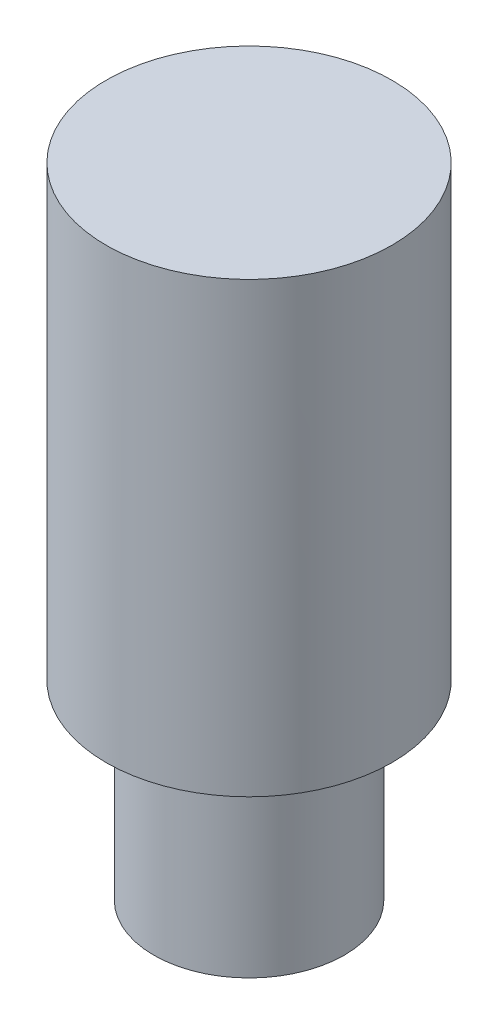
ISO-10303-21;
HEADER;
FILE_DESCRIPTION(('STEP AP214'),'2;1');
FILE_NAME('part.step','',(''),(''),'','','');
FILE_SCHEMA(('AUTOMOTIVE_DESIGN { 1 0 10303 214 1 1 1 1 }'));
ENDSEC;
DATA;
#1=APPLICATION_CONTEXT('core data for automotive mechanical design processes');
#2=APPLICATION_PROTOCOL_DEFINITION('international standard','automotive_design',2000,#1);
#3=PRODUCT_CONTEXT('',#1,'mechanical');
#4=PRODUCT('Part','Part','',(#3));
#5=PRODUCT_RELATED_PRODUCT_CATEGORY('part','',(#4));
#6=PRODUCT_DEFINITION_FORMATION('','',#4);
#7=PRODUCT_DEFINITION_CONTEXT('part definition',#1,'design');
#8=PRODUCT_DEFINITION('design','',#6,#7);
#9=PRODUCT_DEFINITION_SHAPE('','',#8);
#10=(LENGTH_UNIT() NAMED_UNIT(*) SI_UNIT(.MILLI.,.METRE.));
#11=(NAMED_UNIT(*) PLANE_ANGLE_UNIT() SI_UNIT($,.RADIAN.));
#12=(NAMED_UNIT(*) SI_UNIT($,.STERADIAN.) SOLID_ANGLE_UNIT());
#13=UNCERTAINTY_MEASURE_WITH_UNIT(LENGTH_MEASURE(1.E-05),#10,'distance_accuracy_value','');
#14=(GEOMETRIC_REPRESENTATION_CONTEXT(3) GLOBAL_UNCERTAINTY_ASSIGNED_CONTEXT((#13)) GLOBAL_UNIT_ASSIGNED_CONTEXT((#10,
#11,#12)) REPRESENTATION_CONTEXT('',''));
#15=CARTESIAN_POINT('',(0.,0.,0.));
#16=DIRECTION('',(0.,0.,1.));
#17=DIRECTION('',(1.,0.,0.));
#18=AXIS2_PLACEMENT_3D('',#15,#16,#17);
#19=CARTESIAN_POINT('',(0.,2.5,0.));
#20=DIRECTION('',(0.,1.,0.));
#21=DIRECTION('',(0.,0.,1.));
#22=AXIS2_PLACEMENT_3D('',#19,#20,#21);
#23=PLANE('',#22);
#24=CARTESIAN_POINT('',(0.,2.5,0.));
#25=DIRECTION('',(0.,1.,0.));
#26=DIRECTION('',(0.,0.,1.));
#27=AXIS2_PLACEMENT_3D('',#24,#25,#26);
#28=CIRCLE('',#27,3.75);
#29=CARTESIAN_POINT('',(0.,2.5,3.75));
#30=VERTEX_POINT('',#29);
#31=EDGE_CURVE('E48',#30,#30,#28,.T.);
#32=ORIENTED_EDGE('',*,*,#31,.F.);
#33=EDGE_LOOP('',(#32));
#34=FACE_BOUND('',#33,.T.);
#35=ADVANCED_FACE('F41',(#34),#23,.F.);
#36=CARTESIAN_POINT('',(0.,24.8614682080936,0.));
#37=DIRECTION('',(0.,-1.,0.));
#38=DIRECTION('',(0.,0.,-1.));
#39=AXIS2_PLACEMENT_3D('',#36,#37,#38);
#40=CYLINDRICAL_SURFACE('',#39,3.75);
#41=CARTESIAN_POINT('',(0.,14.2548664902954,0.));
#42=DIRECTION('',(0.,-1.,0.));
#43=DIRECTION('',(1.,0.,0.));
#44=AXIS2_PLACEMENT_3D('',#41,#42,#43);
#45=CIRCLE('',#44,3.75);
#46=CARTESIAN_POINT('',(3.75,14.2548664902954,0.));
#47=VERTEX_POINT('',#46);
#48=EDGE_CURVE('E11',#47,#47,#45,.T.);
#49=ORIENTED_EDGE('',*,*,#48,.T.);
#50=EDGE_LOOP('',(#49));
#51=FACE_BOUND('',#50,.T.);
#52=ORIENTED_EDGE('',*,*,#31,.T.);
#53=EDGE_LOOP('',(#52));
#54=FACE_BOUND('',#53,.T.);
#55=ADVANCED_FACE('F43',(#51,#54),#40,.T.);
#56=CARTESIAN_POINT('',(-1.54855022185249,14.2548664902954,3.12902341488536));
#57=DIRECTION('',(0.,-1.,0.));
#58=DIRECTION('',(-0.97166987360786,0.,0.236342244896854));
#59=AXIS2_PLACEMENT_3D('',#56,#57,#58);
#60=PLANE('',#59);
#61=ORIENTED_EDGE('',*,*,#48,.F.);
#62=EDGE_LOOP('',(#61));
#63=FACE_BOUND('',#62,.T.);
#64=ADVANCED_FACE('F59',(#63),#60,.F.);
#65=CLOSED_SHELL('',(#35,#55,#64));
#66=MANIFOLD_SOLID_BREP('B2',#65);
#67=CARTESIAN_POINT('',(0.,-2.5,0.));
#68=DIRECTION('',(0.,1.,0.));
#69=DIRECTION('',(0.,0.,1.));
#70=AXIS2_PLACEMENT_3D('',#67,#68,#69);
#71=CYLINDRICAL_SURFACE('',#70,2.5);
#72=CARTESIAN_POINT('',(0.,-2.5,0.));
#73=DIRECTION('',(0.,1.,0.));
#74=DIRECTION('',(0.,0.,1.));
#75=AXIS2_PLACEMENT_3D('',#72,#73,#74);
#76=CIRCLE('',#75,2.5);
#77=CARTESIAN_POINT('',(0.,-2.5,2.5));
#78=VERTEX_POINT('',#77);
#79=EDGE_CURVE('E40',#78,#78,#76,.T.);
#80=ORIENTED_EDGE('',*,*,#79,.T.);
#81=EDGE_LOOP('',(#80));
#82=FACE_BOUND('',#81,.T.);
#83=CARTESIAN_POINT('',(0.,2.5,0.));
#84=DIRECTION('',(0.,1.,0.));
#85=DIRECTION('',(0.,0.,1.));
#86=AXIS2_PLACEMENT_3D('',#83,#84,#85);
#87=CIRCLE('',#86,2.5);
#88=CARTESIAN_POINT('',(0.,2.5,2.5));
#89=VERTEX_POINT('',#88);
#90=EDGE_CURVE('E85',#89,#89,#87,.T.);
#91=ORIENTED_EDGE('',*,*,#90,.F.);
#92=EDGE_LOOP('',(#91));
#93=FACE_BOUND('',#92,.T.);
#94=ADVANCED_FACE('F82',(#82,#93),#71,.T.);
#95=CARTESIAN_POINT('',(0.,-2.5,0.));
#96=DIRECTION('',(0.,1.,0.));
#97=DIRECTION('',(0.,0.,1.));
#98=AXIS2_PLACEMENT_3D('',#95,#96,#97);
#99=PLANE('',#98);
#100=ORIENTED_EDGE('',*,*,#79,.F.);
#101=EDGE_LOOP('',(#100));
#102=FACE_BOUND('',#101,.T.);
#103=ADVANCED_FACE('F97',(#102),#99,.F.);
#104=CARTESIAN_POINT('',(0.,2.5,0.));
#105=DIRECTION('',(0.,1.,0.));
#106=DIRECTION('',(0.,0.,1.));
#107=AXIS2_PLACEMENT_3D('',#104,#105,#106);
#108=PLANE('',#107);
#109=ORIENTED_EDGE('',*,*,#90,.T.);
#110=EDGE_LOOP('',(#109));
#111=FACE_BOUND('',#110,.T.);
#112=ADVANCED_FACE('F94',(#111),#108,.T.);
#113=CLOSED_SHELL('',(#94,#103,#112));
#114=MANIFOLD_SOLID_BREP('B6',#113);
#115=ADVANCED_BREP_SHAPE_REPRESENTATION('',(#18,#66,#114),#14);
#116=SHAPE_DEFINITION_REPRESENTATION(#9,#115);
ENDSEC;
END-ISO-10303-21;
